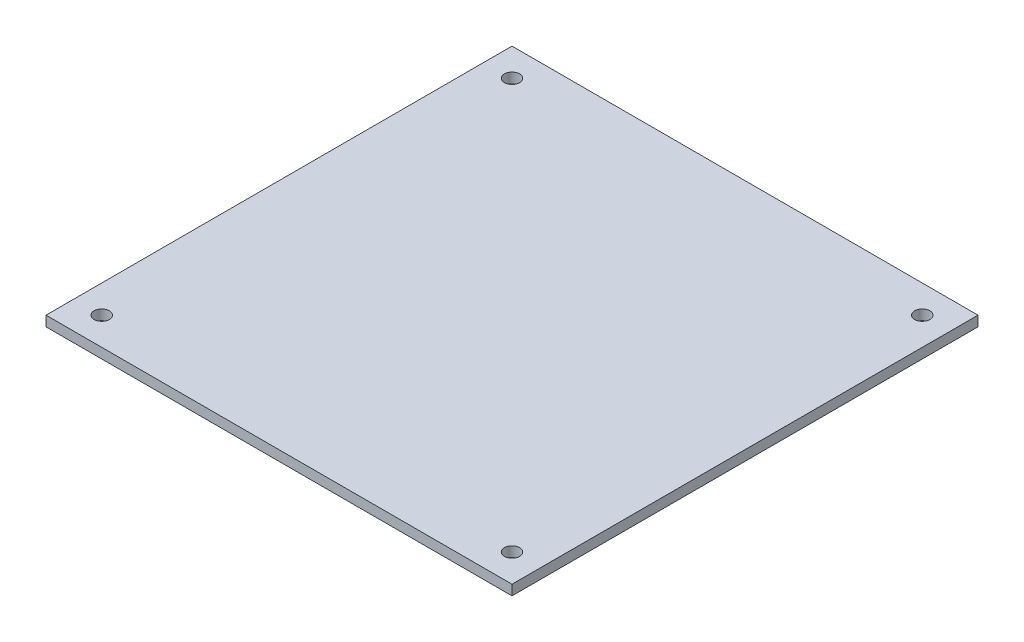
ISO-10303-21;
HEADER;
FILE_DESCRIPTION(('STEP AP214'),'2;1');
FILE_NAME('part.step','',(''),(''),'','','');
FILE_SCHEMA(('AUTOMOTIVE_DESIGN { 1 0 10303 214 1 1 1 1 }'));
ENDSEC;
DATA;
#1=APPLICATION_CONTEXT('core data for automotive mechanical design processes');
#2=APPLICATION_PROTOCOL_DEFINITION('international standard','automotive_design',2000,#1);
#3=PRODUCT_CONTEXT('',#1,'mechanical');
#4=PRODUCT('Part','Part','',(#3));
#5=PRODUCT_RELATED_PRODUCT_CATEGORY('part','',(#4));
#6=PRODUCT_DEFINITION_FORMATION('','',#4);
#7=PRODUCT_DEFINITION_CONTEXT('part definition',#1,'design');
#8=PRODUCT_DEFINITION('design','',#6,#7);
#9=PRODUCT_DEFINITION_SHAPE('','',#8);
#10=(LENGTH_UNIT() NAMED_UNIT(*) SI_UNIT(.MILLI.,.METRE.));
#11=(NAMED_UNIT(*) PLANE_ANGLE_UNIT() SI_UNIT($,.RADIAN.));
#12=(NAMED_UNIT(*) SI_UNIT($,.STERADIAN.) SOLID_ANGLE_UNIT());
#13=UNCERTAINTY_MEASURE_WITH_UNIT(LENGTH_MEASURE(1.E-05),#10,'distance_accuracy_value','');
#14=(GEOMETRIC_REPRESENTATION_CONTEXT(3) GLOBAL_UNCERTAINTY_ASSIGNED_CONTEXT((#13)) GLOBAL_UNIT_ASSIGNED_CONTEXT((#10,
#11,#12)) REPRESENTATION_CONTEXT('',''));
#15=CARTESIAN_POINT('',(0.,0.,0.));
#16=DIRECTION('',(0.,0.,1.));
#17=DIRECTION('',(1.,0.,0.));
#18=AXIS2_PLACEMENT_3D('',#15,#16,#17);
#19=CARTESIAN_POINT('',(0.,2.,45.8050234927139));
#20=DIRECTION('',(0.,0.,-1.));
#21=DIRECTION('',(-1.,0.,0.));
#22=AXIS2_PLACEMENT_3D('',#19,#20,#21);
#23=PLANE('',#22);
#24=DIRECTION('',(1.,0.,0.));
#25=VECTOR('',#24,1.);
#26=CARTESIAN_POINT('',(0.,0.,45.8050234927139));
#27=LINE('',#26,#25);
#28=CARTESIAN_POINT('',(-45.9127717323118,0.,45.8050234927139));
#29=VERTEX_POINT('',#28);
#30=CARTESIAN_POINT('',(46.0872282676881,0.,45.8050234927139));
#31=VERTEX_POINT('',#30);
#32=EDGE_CURVE('E108',#29,#31,#27,.T.);
#33=ORIENTED_EDGE('',*,*,#32,.T.);
#34=DIRECTION('',(0.,-1.,0.));
#35=VECTOR('',#34,1.);
#36=CARTESIAN_POINT('',(46.0872282676881,2.,45.8050234927139));
#37=LINE('',#36,#35);
#38=CARTESIAN_POINT('',(46.0872282676881,2.,45.8050234927139));
#39=VERTEX_POINT('',#38);
#40=EDGE_CURVE('E11',#39,#31,#37,.T.);
#41=ORIENTED_EDGE('',*,*,#40,.F.);
#42=DIRECTION('',(1.,0.,0.));
#43=VECTOR('',#42,1.);
#44=CARTESIAN_POINT('',(0.,2.,45.8050234927139));
#45=LINE('',#44,#43);
#46=CARTESIAN_POINT('',(-45.9127717323118,2.,45.8050234927139));
#47=VERTEX_POINT('',#46);
#48=EDGE_CURVE('E84',#47,#39,#45,.T.);
#49=ORIENTED_EDGE('',*,*,#48,.F.);
#50=DIRECTION('',(0.,-1.,0.));
#51=VECTOR('',#50,1.);
#52=CARTESIAN_POINT('',(-45.9127717323118,2.,45.8050234927139));
#53=LINE('',#52,#51);
#54=EDGE_CURVE('E92',#47,#29,#53,.T.);
#55=ORIENTED_EDGE('',*,*,#54,.T.);
#56=EDGE_LOOP('',(#33,#41,#49,#55));
#57=FACE_BOUND('',#56,.T.);
#58=ADVANCED_FACE('F32',(#57),#23,.F.);
#59=CARTESIAN_POINT('',(46.0872282676881,2.,0.));
#60=DIRECTION('',(-1.,0.,0.));
#61=DIRECTION('',(0.,0.,1.));
#62=AXIS2_PLACEMENT_3D('',#59,#60,#61);
#63=PLANE('',#62);
#64=DIRECTION('',(0.,0.,-1.));
#65=VECTOR('',#64,1.);
#66=CARTESIAN_POINT('',(46.0872282676881,0.,0.));
#67=LINE('',#66,#65);
#68=CARTESIAN_POINT('',(46.0872282676881,0.,-46.1949765072861));
#69=VERTEX_POINT('',#68);
#70=EDGE_CURVE('E88',#31,#69,#67,.T.);
#71=ORIENTED_EDGE('',*,*,#70,.T.);
#72=DIRECTION('',(0.,-1.,0.));
#73=VECTOR('',#72,1.);
#74=CARTESIAN_POINT('',(46.0872282676881,2.,-46.1949765072861));
#75=LINE('',#74,#73);
#76=CARTESIAN_POINT('',(46.0872282676881,2.,-46.1949765072861));
#77=VERTEX_POINT('',#76);
#78=EDGE_CURVE('E41',#77,#69,#75,.T.);
#79=ORIENTED_EDGE('',*,*,#78,.F.);
#80=DIRECTION('',(0.,0.,-1.));
#81=VECTOR('',#80,1.);
#82=CARTESIAN_POINT('',(46.0872282676881,2.,0.));
#83=LINE('',#82,#81);
#84=EDGE_CURVE('E79',#39,#77,#83,.T.);
#85=ORIENTED_EDGE('',*,*,#84,.F.);
#86=ORIENTED_EDGE('',*,*,#40,.T.);
#87=EDGE_LOOP('',(#71,#79,#85,#86));
#88=FACE_BOUND('',#87,.T.);
#89=ADVANCED_FACE('F87',(#88),#63,.F.);
#90=CARTESIAN_POINT('',(0.,2.,-46.1949765072861));
#91=DIRECTION('',(0.,0.,1.));
#92=DIRECTION('',(1.,0.,0.));
#93=AXIS2_PLACEMENT_3D('',#90,#91,#92);
#94=PLANE('',#93);
#95=DIRECTION('',(-1.,0.,0.));
#96=VECTOR('',#95,1.);
#97=CARTESIAN_POINT('',(0.,0.,-46.1949765072861));
#98=LINE('',#97,#96);
#99=CARTESIAN_POINT('',(-45.9127717323118,0.,-46.1949765072861));
#100=VERTEX_POINT('',#99);
#101=EDGE_CURVE('E66',#69,#100,#98,.T.);
#102=ORIENTED_EDGE('',*,*,#101,.T.);
#103=DIRECTION('',(0.,-1.,0.));
#104=VECTOR('',#103,1.);
#105=CARTESIAN_POINT('',(-45.9127717323118,2.,-46.1949765072861));
#106=LINE('',#105,#104);
#107=CARTESIAN_POINT('',(-45.9127717323118,2.,-46.1949765072861));
#108=VERTEX_POINT('',#107);
#109=EDGE_CURVE('E89',#108,#100,#106,.T.);
#110=ORIENTED_EDGE('',*,*,#109,.F.);
#111=DIRECTION('',(-1.,0.,0.));
#112=VECTOR('',#111,1.);
#113=CARTESIAN_POINT('',(0.,2.,-46.1949765072861));
#114=LINE('',#113,#112);
#115=EDGE_CURVE('E82',#77,#108,#114,.T.);
#116=ORIENTED_EDGE('',*,*,#115,.F.);
#117=ORIENTED_EDGE('',*,*,#78,.T.);
#118=EDGE_LOOP('',(#102,#110,#116,#117));
#119=FACE_BOUND('',#118,.T.);
#120=ADVANCED_FACE('F90',(#119),#94,.F.);
#121=CARTESIAN_POINT('',(40.5872282676881,2.,-40.6949765072861));
#122=DIRECTION('',(0.,-1.,0.));
#123=DIRECTION('',(0.,0.,-1.));
#124=AXIS2_PLACEMENT_3D('',#121,#122,#123);
#125=CYLINDRICAL_SURFACE('',#124,1.5);
#126=CARTESIAN_POINT('',(40.5872282676881,2.,-40.6949765072861));
#127=DIRECTION('',(0.,1.,0.));
#128=DIRECTION('',(0.,0.,1.));
#129=AXIS2_PLACEMENT_3D('',#126,#127,#128);
#130=CIRCLE('',#129,1.5);
#131=CARTESIAN_POINT('',(40.5872282676881,2.,-39.1949765072861));
#132=VERTEX_POINT('',#131);
#133=EDGE_CURVE('E121',#132,#132,#130,.T.);
#134=ORIENTED_EDGE('',*,*,#133,.T.);
#135=EDGE_LOOP('',(#134));
#136=FACE_BOUND('',#135,.T.);
#137=CARTESIAN_POINT('',(40.5872282676881,0.,-40.6949765072861));
#138=DIRECTION('',(0.,1.,0.));
#139=DIRECTION('',(0.,0.,1.));
#140=AXIS2_PLACEMENT_3D('',#137,#138,#139);
#141=CIRCLE('',#140,1.5);
#142=CARTESIAN_POINT('',(40.5872282676881,0.,-39.1949765072861));
#143=VERTEX_POINT('',#142);
#144=EDGE_CURVE('E105',#143,#143,#141,.T.);
#145=ORIENTED_EDGE('',*,*,#144,.F.);
#146=EDGE_LOOP('',(#145));
#147=FACE_BOUND('',#146,.T.);
#148=ADVANCED_FACE('F145',(#136,#147),#125,.F.);
#149=CARTESIAN_POINT('',(40.5872282676881,2.,40.3050234927139));
#150=DIRECTION('',(0.,-1.,0.));
#151=DIRECTION('',(0.,0.,-1.));
#152=AXIS2_PLACEMENT_3D('',#149,#150,#151);
#153=CYLINDRICAL_SURFACE('',#152,1.5);
#154=CARTESIAN_POINT('',(40.5872282676881,2.,40.3050234927139));
#155=DIRECTION('',(0.,1.,0.));
#156=DIRECTION('',(0.,0.,1.));
#157=AXIS2_PLACEMENT_3D('',#154,#155,#156);
#158=CIRCLE('',#157,1.5);
#159=CARTESIAN_POINT('',(40.5872282676881,2.,41.8050234927139));
#160=VERTEX_POINT('',#159);
#161=EDGE_CURVE('E123',#160,#160,#158,.T.);
#162=ORIENTED_EDGE('',*,*,#161,.T.);
#163=EDGE_LOOP('',(#162));
#164=FACE_BOUND('',#163,.T.);
#165=CARTESIAN_POINT('',(40.5872282676881,0.,40.3050234927139));
#166=DIRECTION('',(0.,1.,0.));
#167=DIRECTION('',(0.,0.,1.));
#168=AXIS2_PLACEMENT_3D('',#165,#166,#167);
#169=CIRCLE('',#168,1.5);
#170=CARTESIAN_POINT('',(40.5872282676881,0.,41.8050234927139));
#171=VERTEX_POINT('',#170);
#172=EDGE_CURVE('E102',#171,#171,#169,.T.);
#173=ORIENTED_EDGE('',*,*,#172,.F.);
#174=EDGE_LOOP('',(#173));
#175=FACE_BOUND('',#174,.T.);
#176=ADVANCED_FACE('F148',(#164,#175),#153,.F.);
#177=CARTESIAN_POINT('',(-40.4127717323117,2.,40.3050234927139));
#178=DIRECTION('',(0.,-1.,0.));
#179=DIRECTION('',(0.,0.,-1.));
#180=AXIS2_PLACEMENT_3D('',#177,#178,#179);
#181=CYLINDRICAL_SURFACE('',#180,1.5);
#182=CARTESIAN_POINT('',(-40.4127717323117,2.,40.3050234927139));
#183=DIRECTION('',(0.,1.,0.));
#184=DIRECTION('',(0.,0.,1.));
#185=AXIS2_PLACEMENT_3D('',#182,#183,#184);
#186=CIRCLE('',#185,1.5);
#187=CARTESIAN_POINT('',(-40.4127717323117,2.,41.8050234927139));
#188=VERTEX_POINT('',#187);
#189=EDGE_CURVE('E128',#188,#188,#186,.T.);
#190=ORIENTED_EDGE('',*,*,#189,.T.);
#191=EDGE_LOOP('',(#190));
#192=FACE_BOUND('',#191,.T.);
#193=CARTESIAN_POINT('',(-40.4127717323117,0.,40.3050234927139));
#194=DIRECTION('',(0.,1.,0.));
#195=DIRECTION('',(0.,0.,1.));
#196=AXIS2_PLACEMENT_3D('',#193,#194,#195);
#197=CIRCLE('',#196,1.5);
#198=CARTESIAN_POINT('',(-40.4127717323117,0.,41.8050234927139));
#199=VERTEX_POINT('',#198);
#200=EDGE_CURVE('E99',#199,#199,#197,.T.);
#201=ORIENTED_EDGE('',*,*,#200,.F.);
#202=EDGE_LOOP('',(#201));
#203=FACE_BOUND('',#202,.T.);
#204=ADVANCED_FACE('F168',(#192,#203),#181,.F.);
#205=CARTESIAN_POINT('',(-40.4127717323117,2.,-40.6949765072862));
#206=DIRECTION('',(0.,-1.,0.));
#207=DIRECTION('',(0.,0.,-1.));
#208=AXIS2_PLACEMENT_3D('',#205,#206,#207);
#209=CYLINDRICAL_SURFACE('',#208,1.50000000000003);
#210=CARTESIAN_POINT('',(-40.4127717323117,2.,-40.6949765072862));
#211=DIRECTION('',(0.,1.,0.));
#212=DIRECTION('',(0.,0.,1.));
#213=AXIS2_PLACEMENT_3D('',#210,#211,#212);
#214=CIRCLE('',#213,1.50000000000003);
#215=CARTESIAN_POINT('',(-40.4127717323117,2.,-39.1949765072861));
#216=VERTEX_POINT('',#215);
#217=EDGE_CURVE('E114',#216,#216,#214,.T.);
#218=ORIENTED_EDGE('',*,*,#217,.T.);
#219=EDGE_LOOP('',(#218));
#220=FACE_BOUND('',#219,.T.);
#221=CARTESIAN_POINT('',(-40.4127717323117,0.,-40.6949765072862));
#222=DIRECTION('',(0.,1.,0.));
#223=DIRECTION('',(0.,0.,1.));
#224=AXIS2_PLACEMENT_3D('',#221,#222,#223);
#225=CIRCLE('',#224,1.50000000000003);
#226=CARTESIAN_POINT('',(-40.4127717323117,0.,-39.1949765072861));
#227=VERTEX_POINT('',#226);
#228=EDGE_CURVE('E96',#227,#227,#225,.T.);
#229=ORIENTED_EDGE('',*,*,#228,.F.);
#230=EDGE_LOOP('',(#229));
#231=FACE_BOUND('',#230,.T.);
#232=ADVANCED_FACE('F34',(#220,#231),#209,.F.);
#233=CARTESIAN_POINT('',(-45.9127717323118,2.,0.));
#234=DIRECTION('',(1.,0.,0.));
#235=DIRECTION('',(0.,0.,-1.));
#236=AXIS2_PLACEMENT_3D('',#233,#234,#235);
#237=PLANE('',#236);
#238=DIRECTION('',(0.,0.,1.));
#239=VECTOR('',#238,1.);
#240=CARTESIAN_POINT('',(-45.9127717323118,0.,0.));
#241=LINE('',#240,#239);
#242=EDGE_CURVE('E72',#100,#29,#241,.T.);
#243=ORIENTED_EDGE('',*,*,#242,.T.);
#244=ORIENTED_EDGE('',*,*,#54,.F.);
#245=DIRECTION('',(0.,0.,1.));
#246=VECTOR('',#245,1.);
#247=CARTESIAN_POINT('',(-45.9127717323118,2.,0.));
#248=LINE('',#247,#246);
#249=EDGE_CURVE('E49',#108,#47,#248,.T.);
#250=ORIENTED_EDGE('',*,*,#249,.F.);
#251=ORIENTED_EDGE('',*,*,#109,.T.);
#252=EDGE_LOOP('',(#243,#244,#250,#251));
#253=FACE_BOUND('',#252,.T.);
#254=ADVANCED_FACE('F116',(#253),#237,.F.);
#255=CARTESIAN_POINT('',(0.,2.,0.));
#256=DIRECTION('',(0.,1.,0.));
#257=DIRECTION('',(0.,0.,1.));
#258=AXIS2_PLACEMENT_3D('',#255,#256,#257);
#259=PLANE('',#258);
#260=ORIENTED_EDGE('',*,*,#217,.F.);
#261=EDGE_LOOP('',(#260));
#262=FACE_BOUND('',#261,.T.);
#263=ORIENTED_EDGE('',*,*,#189,.F.);
#264=EDGE_LOOP('',(#263));
#265=FACE_BOUND('',#264,.T.);
#266=ORIENTED_EDGE('',*,*,#161,.F.);
#267=EDGE_LOOP('',(#266));
#268=FACE_BOUND('',#267,.T.);
#269=ORIENTED_EDGE('',*,*,#133,.F.);
#270=EDGE_LOOP('',(#269));
#271=FACE_BOUND('',#270,.T.);
#272=ORIENTED_EDGE('',*,*,#48,.T.);
#273=ORIENTED_EDGE('',*,*,#84,.T.);
#274=ORIENTED_EDGE('',*,*,#115,.T.);
#275=ORIENTED_EDGE('',*,*,#249,.T.);
#276=EDGE_LOOP('',(#272,#273,#274,#275));
#277=FACE_BOUND('',#276,.T.);
#278=ADVANCED_FACE('F80',(#262,#265,#268,#271,#277),#259,.T.);
#279=CARTESIAN_POINT('',(0.,0.,0.));
#280=DIRECTION('',(0.,1.,0.));
#281=DIRECTION('',(0.,0.,1.));
#282=AXIS2_PLACEMENT_3D('',#279,#280,#281);
#283=PLANE('',#282);
#284=ORIENTED_EDGE('',*,*,#228,.T.);
#285=EDGE_LOOP('',(#284));
#286=FACE_BOUND('',#285,.T.);
#287=ORIENTED_EDGE('',*,*,#200,.T.);
#288=EDGE_LOOP('',(#287));
#289=FACE_BOUND('',#288,.T.);
#290=ORIENTED_EDGE('',*,*,#172,.T.);
#291=EDGE_LOOP('',(#290));
#292=FACE_BOUND('',#291,.T.);
#293=ORIENTED_EDGE('',*,*,#144,.T.);
#294=EDGE_LOOP('',(#293));
#295=FACE_BOUND('',#294,.T.);
#296=ORIENTED_EDGE('',*,*,#32,.F.);
#297=ORIENTED_EDGE('',*,*,#242,.F.);
#298=ORIENTED_EDGE('',*,*,#101,.F.);
#299=ORIENTED_EDGE('',*,*,#70,.F.);
#300=EDGE_LOOP('',(#296,#297,#298,#299));
#301=FACE_BOUND('',#300,.T.);
#302=ADVANCED_FACE('F119',(#286,#289,#292,#295,#301),#283,.F.);
#303=CLOSED_SHELL('',(#58,#89,#120,#148,#176,#204,#232,#254,#278,#302));
#304=MANIFOLD_SOLID_BREP('B2',#303);
#305=ADVANCED_BREP_SHAPE_REPRESENTATION('',(#18,#304),#14);
#306=SHAPE_DEFINITION_REPRESENTATION(#9,#305);
ENDSEC;
END-ISO-10303-21;
